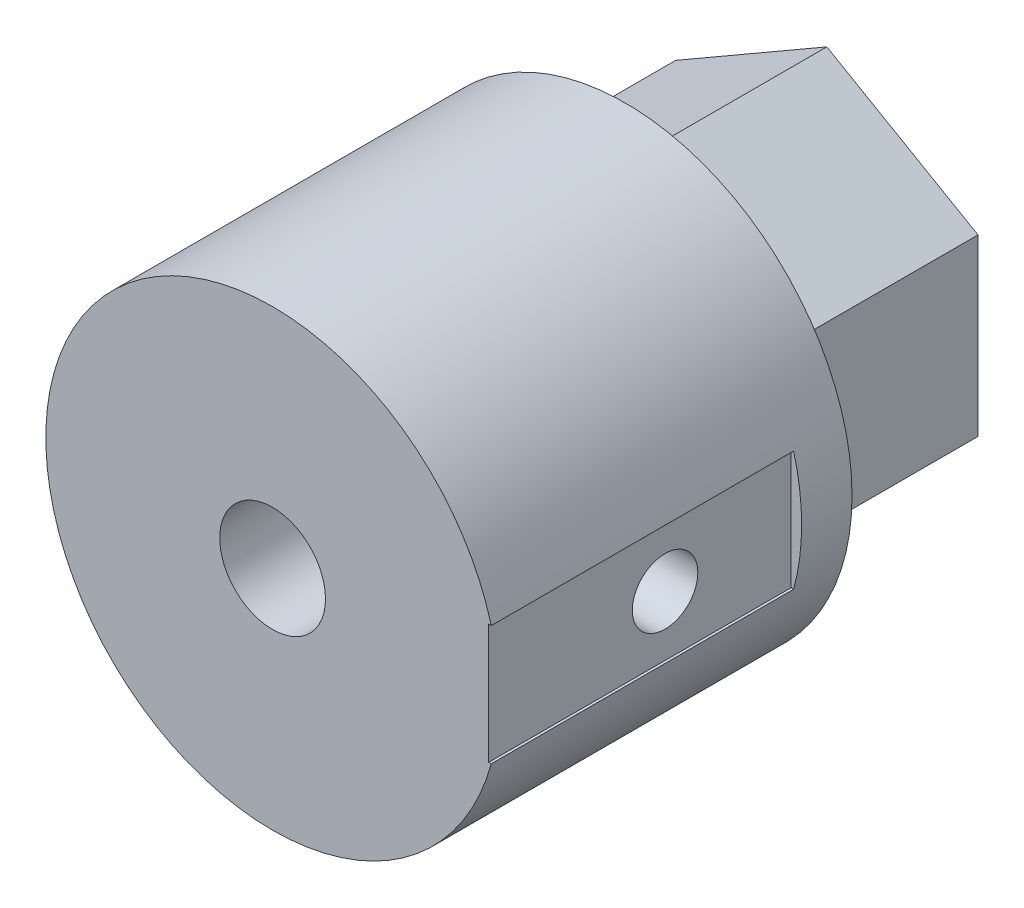
ISO-10303-21;
HEADER;
FILE_DESCRIPTION(('STEP AP214'),'2;1');
FILE_NAME('part.step','',(''),(''),'','','');
FILE_SCHEMA(('AUTOMOTIVE_DESIGN { 1 0 10303 214 1 1 1 1 }'));
ENDSEC;
DATA;
#1=APPLICATION_CONTEXT('core data for automotive mechanical design processes');
#2=APPLICATION_PROTOCOL_DEFINITION('international standard','automotive_design',2000,#1);
#3=PRODUCT_CONTEXT('',#1,'mechanical');
#4=PRODUCT('Part','Part','',(#3));
#5=PRODUCT_RELATED_PRODUCT_CATEGORY('part','',(#4));
#6=PRODUCT_DEFINITION_FORMATION('','',#4);
#7=PRODUCT_DEFINITION_CONTEXT('part definition',#1,'design');
#8=PRODUCT_DEFINITION('design','',#6,#7);
#9=PRODUCT_DEFINITION_SHAPE('','',#8);
#10=(LENGTH_UNIT() NAMED_UNIT(*) SI_UNIT(.MILLI.,.METRE.));
#11=(NAMED_UNIT(*) PLANE_ANGLE_UNIT() SI_UNIT($,.RADIAN.));
#12=(NAMED_UNIT(*) SI_UNIT($,.STERADIAN.) SOLID_ANGLE_UNIT());
#13=UNCERTAINTY_MEASURE_WITH_UNIT(LENGTH_MEASURE(1.E-05),#10,'distance_accuracy_value','');
#14=(GEOMETRIC_REPRESENTATION_CONTEXT(3) GLOBAL_UNCERTAINTY_ASSIGNED_CONTEXT((#13)) GLOBAL_UNIT_ASSIGNED_CONTEXT((#10,
#11,#12)) REPRESENTATION_CONTEXT('',''));
#15=CARTESIAN_POINT('',(0.,0.,0.));
#16=DIRECTION('',(0.,0.,1.));
#17=DIRECTION('',(1.,0.,0.));
#18=AXIS2_PLACEMENT_3D('',#15,#16,#17);
#19=CARTESIAN_POINT('',(6.,-3.46410161513775,22.));
#20=DIRECTION('',(-1.,0.,0.));
#21=DIRECTION('',(0.,-1.,0.));
#22=AXIS2_PLACEMENT_3D('',#19,#20,#21);
#23=PLANE('',#22);
#24=DIRECTION('',(0.,1.,0.));
#25=VECTOR('',#24,1.);
#26=CARTESIAN_POINT('',(6.,-3.46410161513775,8.));
#27=LINE('',#26,#25);
#28=CARTESIAN_POINT('',(6.,-3.46410161513775,8.));
#29=VERTEX_POINT('',#28);
#30=CARTESIAN_POINT('',(6.,3.46410161513775,8.));
#31=VERTEX_POINT('',#30);
#32=EDGE_CURVE('E165',#29,#31,#27,.T.);
#33=ORIENTED_EDGE('',*,*,#32,.F.);
#34=DIRECTION('',(0.,0.,-1.));
#35=VECTOR('',#34,1.);
#36=CARTESIAN_POINT('',(6.,-3.46410161513775,22.));
#37=LINE('',#36,#35);
#38=CARTESIAN_POINT('',(6.,-3.46410161513775,0.));
#39=VERTEX_POINT('',#38);
#40=EDGE_CURVE('E187',#29,#39,#37,.T.);
#41=ORIENTED_EDGE('',*,*,#40,.T.);
#42=DIRECTION('',(0.,1.,0.));
#43=VECTOR('',#42,1.);
#44=CARTESIAN_POINT('',(6.,-3.46410161513775,0.));
#45=LINE('',#44,#43);
#46=CARTESIAN_POINT('',(6.,3.46410161513775,0.));
#47=VERTEX_POINT('',#46);
#48=EDGE_CURVE('E169',#39,#47,#45,.T.);
#49=ORIENTED_EDGE('',*,*,#48,.T.);
#50=DIRECTION('',(0.,0.,-1.));
#51=VECTOR('',#50,1.);
#52=CARTESIAN_POINT('',(6.,3.46410161513775,22.));
#53=LINE('',#52,#51);
#54=EDGE_CURVE('E197',#31,#47,#53,.T.);
#55=ORIENTED_EDGE('',*,*,#54,.F.);
#56=EDGE_LOOP('',(#33,#41,#49,#55));
#57=FACE_BOUND('',#56,.T.);
#58=ADVANCED_FACE('F34',(#57),#23,.F.);
#59=CARTESIAN_POINT('',(6.,3.46410161513775,22.));
#60=DIRECTION('',(-0.5,-0.866025403784438,0.));
#61=DIRECTION('',(0.866025403784439,-0.5,0.));
#62=AXIS2_PLACEMENT_3D('',#59,#60,#61);
#63=PLANE('',#62);
#64=DIRECTION('',(-0.866025403784439,0.5,0.));
#65=VECTOR('',#64,1.);
#66=CARTESIAN_POINT('',(6.,3.46410161513775,8.));
#67=LINE('',#66,#65);
#68=CARTESIAN_POINT('',(0.,6.92820323027551,8.));
#69=VERTEX_POINT('',#68);
#70=EDGE_CURVE('E60',#31,#69,#67,.T.);
#71=ORIENTED_EDGE('',*,*,#70,.F.);
#72=ORIENTED_EDGE('',*,*,#54,.T.);
#73=DIRECTION('',(-0.866025403784439,0.5,0.));
#74=VECTOR('',#73,1.);
#75=CARTESIAN_POINT('',(6.,3.46410161513775,0.));
#76=LINE('',#75,#74);
#77=CARTESIAN_POINT('',(0.,6.92820323027551,0.));
#78=VERTEX_POINT('',#77);
#79=EDGE_CURVE('E172',#47,#78,#76,.T.);
#80=ORIENTED_EDGE('',*,*,#79,.T.);
#81=DIRECTION('',(0.,0.,-1.));
#82=VECTOR('',#81,1.);
#83=CARTESIAN_POINT('',(0.,6.92820323027551,22.));
#84=LINE('',#83,#82);
#85=EDGE_CURVE('E195',#69,#78,#84,.T.);
#86=ORIENTED_EDGE('',*,*,#85,.F.);
#87=EDGE_LOOP('',(#71,#72,#80,#86));
#88=FACE_BOUND('',#87,.T.);
#89=ADVANCED_FACE('F225',(#88),#63,.F.);
#90=CARTESIAN_POINT('',(0.,6.92820323027551,22.));
#91=DIRECTION('',(0.5,-0.866025403784439,0.));
#92=DIRECTION('',(0.866025403784439,0.5,0.));
#93=AXIS2_PLACEMENT_3D('',#90,#91,#92);
#94=PLANE('',#93);
#95=DIRECTION('',(-0.866025403784439,-0.5,0.));
#96=VECTOR('',#95,1.);
#97=CARTESIAN_POINT('',(0.,6.92820323027551,8.));
#98=LINE('',#97,#96);
#99=CARTESIAN_POINT('',(-6.,3.46410161513775,8.));
#100=VERTEX_POINT('',#99);
#101=EDGE_CURVE('E161',#69,#100,#98,.T.);
#102=ORIENTED_EDGE('',*,*,#101,.F.);
#103=ORIENTED_EDGE('',*,*,#85,.T.);
#104=DIRECTION('',(-0.866025403784439,-0.5,0.));
#105=VECTOR('',#104,1.);
#106=CARTESIAN_POINT('',(0.,6.92820323027551,0.));
#107=LINE('',#106,#105);
#108=CARTESIAN_POINT('',(-6.,3.46410161513775,0.));
#109=VERTEX_POINT('',#108);
#110=EDGE_CURVE('E175',#78,#109,#107,.T.);
#111=ORIENTED_EDGE('',*,*,#110,.T.);
#112=DIRECTION('',(0.,0.,-1.));
#113=VECTOR('',#112,1.);
#114=CARTESIAN_POINT('',(-6.,3.46410161513775,22.));
#115=LINE('',#114,#113);
#116=EDGE_CURVE('E193',#100,#109,#115,.T.);
#117=ORIENTED_EDGE('',*,*,#116,.F.);
#118=EDGE_LOOP('',(#102,#103,#111,#117));
#119=FACE_BOUND('',#118,.T.);
#120=ADVANCED_FACE('F230',(#119),#94,.F.);
#121=CARTESIAN_POINT('',(-6.,3.46410161513775,22.));
#122=DIRECTION('',(1.,0.,0.));
#123=DIRECTION('',(0.,1.,0.));
#124=AXIS2_PLACEMENT_3D('',#121,#122,#123);
#125=PLANE('',#124);
#126=DIRECTION('',(0.,-1.,0.));
#127=VECTOR('',#126,1.);
#128=CARTESIAN_POINT('',(-6.,3.46410161513775,8.));
#129=LINE('',#128,#127);
#130=CARTESIAN_POINT('',(-6.,-3.46410161513776,8.));
#131=VERTEX_POINT('',#130);
#132=EDGE_CURVE('E158',#100,#131,#129,.T.);
#133=ORIENTED_EDGE('',*,*,#132,.F.);
#134=ORIENTED_EDGE('',*,*,#116,.T.);
#135=DIRECTION('',(0.,-1.,0.));
#136=VECTOR('',#135,1.);
#137=CARTESIAN_POINT('',(-6.,3.46410161513775,0.));
#138=LINE('',#137,#136);
#139=CARTESIAN_POINT('',(-6.,-3.46410161513776,0.));
#140=VERTEX_POINT('',#139);
#141=EDGE_CURVE('E178',#109,#140,#138,.T.);
#142=ORIENTED_EDGE('',*,*,#141,.T.);
#143=DIRECTION('',(0.,0.,-1.));
#144=VECTOR('',#143,1.);
#145=CARTESIAN_POINT('',(-6.,-3.46410161513776,22.));
#146=LINE('',#145,#144);
#147=EDGE_CURVE('E191',#131,#140,#146,.T.);
#148=ORIENTED_EDGE('',*,*,#147,.F.);
#149=EDGE_LOOP('',(#133,#134,#142,#148));
#150=FACE_BOUND('',#149,.T.);
#151=ADVANCED_FACE('F250',(#150),#125,.F.);
#152=CARTESIAN_POINT('',(-6.,-3.46410161513776,22.));
#153=DIRECTION('',(0.5,0.866025403784439,0.));
#154=DIRECTION('',(-0.866025403784439,0.5,0.));
#155=AXIS2_PLACEMENT_3D('',#152,#153,#154);
#156=PLANE('',#155);
#157=DIRECTION('',(0.866025403784439,-0.5,0.));
#158=VECTOR('',#157,1.);
#159=CARTESIAN_POINT('',(-6.,-3.46410161513776,8.));
#160=LINE('',#159,#158);
#161=CARTESIAN_POINT('',(0.,-6.92820323027551,8.));
#162=VERTEX_POINT('',#161);
#163=EDGE_CURVE('E155',#131,#162,#160,.T.);
#164=ORIENTED_EDGE('',*,*,#163,.F.);
#165=ORIENTED_EDGE('',*,*,#147,.T.);
#166=DIRECTION('',(0.866025403784439,-0.5,0.));
#167=VECTOR('',#166,1.);
#168=CARTESIAN_POINT('',(-6.,-3.46410161513776,0.));
#169=LINE('',#168,#167);
#170=CARTESIAN_POINT('',(0.,-6.92820323027551,0.));
#171=VERTEX_POINT('',#170);
#172=EDGE_CURVE('E181',#140,#171,#169,.T.);
#173=ORIENTED_EDGE('',*,*,#172,.T.);
#174=DIRECTION('',(0.,0.,-1.));
#175=VECTOR('',#174,1.);
#176=CARTESIAN_POINT('',(0.,-6.92820323027551,22.));
#177=LINE('',#176,#175);
#178=EDGE_CURVE('E189',#162,#171,#177,.T.);
#179=ORIENTED_EDGE('',*,*,#178,.F.);
#180=EDGE_LOOP('',(#164,#165,#173,#179));
#181=FACE_BOUND('',#180,.T.);
#182=ADVANCED_FACE('F237',(#181),#156,.F.);
#183=CARTESIAN_POINT('',(0.,-6.92820323027551,22.));
#184=DIRECTION('',(-0.5,0.866025403784439,0.));
#185=DIRECTION('',(-0.866025403784439,-0.5,0.));
#186=AXIS2_PLACEMENT_3D('',#183,#184,#185);
#187=PLANE('',#186);
#188=DIRECTION('',(0.866025403784439,0.5,0.));
#189=VECTOR('',#188,1.);
#190=CARTESIAN_POINT('',(0.,-6.92820323027551,8.));
#191=LINE('',#190,#189);
#192=EDGE_CURVE('E150',#162,#29,#191,.T.);
#193=ORIENTED_EDGE('',*,*,#192,.F.);
#194=ORIENTED_EDGE('',*,*,#178,.T.);
#195=DIRECTION('',(0.866025403784439,0.5,0.));
#196=VECTOR('',#195,1.);
#197=CARTESIAN_POINT('',(0.,-6.92820323027551,0.));
#198=LINE('',#197,#196);
#199=EDGE_CURVE('E184',#171,#39,#198,.T.);
#200=ORIENTED_EDGE('',*,*,#199,.T.);
#201=ORIENTED_EDGE('',*,*,#40,.F.);
#202=EDGE_LOOP('',(#193,#194,#200,#201));
#203=FACE_BOUND('',#202,.T.);
#204=ADVANCED_FACE('F235',(#203),#187,.F.);
#205=CARTESIAN_POINT('',(0.,0.,-1.00000000000001));
#206=DIRECTION('',(0.,0.,1.));
#207=DIRECTION('',(1.,0.,0.));
#208=AXIS2_PLACEMENT_3D('',#205,#206,#207);
#209=CYLINDRICAL_SURFACE('',#208,1.7);
#210=CARTESIAN_POINT('',(0.,0.,0.));
#211=DIRECTION('',(0.,0.,1.));
#212=DIRECTION('',(1.,0.,0.));
#213=AXIS2_PLACEMENT_3D('',#210,#211,#212);
#214=CIRCLE('',#213,1.7);
#215=CARTESIAN_POINT('',(1.7,0.,0.));
#216=VERTEX_POINT('',#215);
#217=EDGE_CURVE('E168',#216,#216,#214,.T.);
#218=ORIENTED_EDGE('',*,*,#217,.F.);
#219=EDGE_LOOP('',(#218));
#220=FACE_BOUND('',#219,.T.);
#221=CARTESIAN_POINT('',(0.,0.,7.99999999999999));
#222=DIRECTION('',(0.,0.,1.));
#223=DIRECTION('',(1.,0.,0.));
#224=AXIS2_PLACEMENT_3D('',#221,#222,#223);
#225=CIRCLE('',#224,1.7);
#226=CARTESIAN_POINT('',(1.7,0.,7.99999999999999));
#227=VERTEX_POINT('',#226);
#228=EDGE_CURVE('E297',#227,#227,#225,.F.);
#229=ORIENTED_EDGE('',*,*,#228,.F.);
#230=EDGE_LOOP('',(#229));
#231=FACE_BOUND('',#230,.T.);
#232=ADVANCED_FACE('F262',(#220,#231),#209,.F.);
#233=CARTESIAN_POINT('',(0.,0.,0.));
#234=DIRECTION('',(0.,0.,1.));
#235=DIRECTION('',(1.,0.,0.));
#236=AXIS2_PLACEMENT_3D('',#233,#234,#235);
#237=PLANE('',#236);
#238=ORIENTED_EDGE('',*,*,#217,.T.);
#239=EDGE_LOOP('',(#238));
#240=FACE_BOUND('',#239,.T.);
#241=ORIENTED_EDGE('',*,*,#48,.F.);
#242=ORIENTED_EDGE('',*,*,#199,.F.);
#243=ORIENTED_EDGE('',*,*,#172,.F.);
#244=ORIENTED_EDGE('',*,*,#141,.F.);
#245=ORIENTED_EDGE('',*,*,#110,.F.);
#246=ORIENTED_EDGE('',*,*,#79,.F.);
#247=EDGE_LOOP('',(#241,#242,#243,#244,#245,#246));
#248=FACE_BOUND('',#247,.T.);
#249=ADVANCED_FACE('F244',(#240,#248),#237,.F.);
#250=CARTESIAN_POINT('',(0.,0.,22.));
#251=DIRECTION('',(0.,0.,1.));
#252=DIRECTION('',(1.,0.,0.));
#253=AXIS2_PLACEMENT_3D('',#250,#251,#252);
#254=PLANE('',#253);
#255=CARTESIAN_POINT('',(0.,0.,22.));
#256=DIRECTION('',(0.,0.,1.));
#257=DIRECTION('',(1.,0.,0.));
#258=AXIS2_PLACEMENT_3D('',#255,#256,#257);
#259=CIRCLE('',#258,2.1);
#260=CARTESIAN_POINT('',(2.1,0.,22.));
#261=VERTEX_POINT('',#260);
#262=EDGE_CURVE('E298',#261,#261,#259,.T.);
#263=ORIENTED_EDGE('',*,*,#262,.F.);
#264=EDGE_LOOP('',(#263));
#265=FACE_BOUND('',#264,.T.);
#266=DIRECTION('',(1.,0.,0.));
#267=VECTOR('',#266,1.);
#268=CARTESIAN_POINT('',(8.57868638007796,-2.37573749863627,22.));
#269=LINE('',#268,#267);
#270=CARTESIAN_POINT('',(8.57868638007796,-2.37573749863627,22.));
#271=VERTEX_POINT('',#270);
#272=CARTESIAN_POINT('',(8.68077596402381,-2.37573749863627,22.));
#273=VERTEX_POINT('',#272);
#274=EDGE_CURVE('E123',#271,#273,#269,.T.);
#275=ORIENTED_EDGE('',*,*,#274,.F.);
#276=DIRECTION('',(0.,-1.,0.));
#277=VECTOR('',#276,1.);
#278=CARTESIAN_POINT('',(8.57868638007796,-2.37573749863627,22.));
#279=LINE('',#278,#277);
#280=CARTESIAN_POINT('',(8.57868638007796,2.37573749863626,22.));
#281=VERTEX_POINT('',#280);
#282=EDGE_CURVE('E141',#281,#271,#279,.T.);
#283=ORIENTED_EDGE('',*,*,#282,.F.);
#284=DIRECTION('',(-1.,0.,0.));
#285=VECTOR('',#284,1.);
#286=CARTESIAN_POINT('',(8.57868638007796,2.37573749863626,22.));
#287=LINE('',#286,#285);
#288=CARTESIAN_POINT('',(8.68077596402381,2.37573749863626,22.));
#289=VERTEX_POINT('',#288);
#290=EDGE_CURVE('E129',#289,#281,#287,.T.);
#291=ORIENTED_EDGE('',*,*,#290,.F.);
#292=CARTESIAN_POINT('',(0.,0.,22.));
#293=DIRECTION('',(0.,0.,1.));
#294=DIRECTION('',(1.,0.,0.));
#295=AXIS2_PLACEMENT_3D('',#292,#293,#294);
#296=CIRCLE('',#295,9.);
#297=EDGE_CURVE('E145',#289,#273,#296,.T.);
#298=ORIENTED_EDGE('',*,*,#297,.T.);
#299=EDGE_LOOP('',(#275,#283,#291,#298));
#300=FACE_BOUND('',#299,.T.);
#301=ADVANCED_FACE('F206',(#265,#300),#254,.T.);
#302=CARTESIAN_POINT('',(0.,0.,8.));
#303=DIRECTION('',(0.,0.,1.));
#304=DIRECTION('',(1.,0.,0.));
#305=AXIS2_PLACEMENT_3D('',#302,#303,#304);
#306=PLANE('',#305);
#307=CARTESIAN_POINT('',(0.,0.,8.));
#308=DIRECTION('',(0.,0.,1.));
#309=DIRECTION('',(1.,0.,0.));
#310=AXIS2_PLACEMENT_3D('',#307,#308,#309);
#311=CIRCLE('',#310,9.);
#312=CARTESIAN_POINT('',(9.,0.,8.));
#313=VERTEX_POINT('',#312);
#314=EDGE_CURVE('E147',#313,#313,#311,.T.);
#315=ORIENTED_EDGE('',*,*,#314,.F.);
#316=EDGE_LOOP('',(#315));
#317=FACE_BOUND('',#316,.T.);
#318=ORIENTED_EDGE('',*,*,#192,.T.);
#319=ORIENTED_EDGE('',*,*,#32,.T.);
#320=ORIENTED_EDGE('',*,*,#70,.T.);
#321=ORIENTED_EDGE('',*,*,#101,.T.);
#322=ORIENTED_EDGE('',*,*,#132,.T.);
#323=ORIENTED_EDGE('',*,*,#163,.T.);
#324=EDGE_LOOP('',(#318,#319,#320,#321,#322,#323));
#325=FACE_BOUND('',#324,.T.);
#326=ADVANCED_FACE('F220',(#317,#325),#306,.F.);
#327=CARTESIAN_POINT('',(0.,0.,8.));
#328=DIRECTION('',(0.,0.,1.));
#329=DIRECTION('',(1.,0.,0.));
#330=AXIS2_PLACEMENT_3D('',#327,#328,#329);
#331=CYLINDRICAL_SURFACE('',#330,9.);
#332=CARTESIAN_POINT('',(-9.,0.,13.7));
#333=CARTESIAN_POINT('',(-8.99999886685049,-0.0726161825161227,13.7000030179057));
#334=CARTESIAN_POINT('',(-8.99911192088851,-0.145275273356691,13.7061048925621));
#335=CARTESIAN_POINT('',(-8.99565906742254,-0.288564680588737,13.7303462177474));
#336=CARTESIAN_POINT('',(-8.9930914970246,-0.359192915218875,13.7484975909057));
#337=CARTESIAN_POINT('',(-8.98656610157761,-0.49632601369094,13.7962860504916));
#338=CARTESIAN_POINT('',(-8.98260930038149,-0.562833871867999,13.8259146799222));
#339=CARTESIAN_POINT('',(-8.97374334347608,-0.689922979183434,13.8957964288494));
#340=CARTESIAN_POINT('',(-8.96883432739334,-0.750505095276922,13.9360479909805));
#341=CARTESIAN_POINT('',(-8.95857047423112,-0.864473940159737,14.0263448505381));
#342=CARTESIAN_POINT('',(-8.95321294862107,-0.917811379037878,14.076452060509));
#343=CARTESIAN_POINT('',(-8.94267709434867,-1.01535172198024,14.1849046681725));
#344=CARTESIAN_POINT('',(-8.93749877571418,-1.05955411556233,14.2432505259486));
#345=CARTESIAN_POINT('',(-8.92788149846685,-1.13775964079836,14.3668529449777));
#346=CARTESIAN_POINT('',(-8.92344601308425,-1.17171542458719,14.4321397577465));
#347=CARTESIAN_POINT('',(-8.91585306506849,-1.22816132370236,14.5675644894435));
#348=CARTESIAN_POINT('',(-8.91269553787813,-1.25065201821292,14.6377021631165));
#349=CARTESIAN_POINT('',(-8.90804229933286,-1.28337696964788,14.7803207327257));
#350=CARTESIAN_POINT('',(-8.90653518527196,-1.2936953638146,14.8527819439515));
#351=CARTESIAN_POINT('',(-8.90531874187228,-1.30204339248276,14.9984218561183));
#352=CARTESIAN_POINT('',(-8.90560931670267,-1.30007368203592,15.071600518606));
#353=CARTESIAN_POINT('',(-8.9079449895514,-1.28397024472981,15.2160056168021));
#354=CARTESIAN_POINT('',(-8.90997660637288,-1.26992997965499,15.2872427243279));
#355=CARTESIAN_POINT('',(-8.91554440166498,-1.23023017528381,15.4263392258918));
#356=CARTESIAN_POINT('',(-8.91908061985619,-1.20457032923634,15.4941985307051));
#357=CARTESIAN_POINT('',(-8.92727416310496,-1.14226177749905,15.6248989335556));
#358=CARTESIAN_POINT('',(-8.93193553951083,-1.10557324101686,15.6877207787645));
#359=CARTESIAN_POINT('',(-8.94185120777938,-1.02227715681356,15.806351737727));
#360=CARTESIAN_POINT('',(-8.94710553575573,-0.975669004785745,15.8621604239067));
#361=CARTESIAN_POINT('',(-8.95767473328203,-0.873342522317744,15.9657227277226));
#362=CARTESIAN_POINT('',(-8.96298971271745,-0.81754378704045,16.0133969246415));
#363=CARTESIAN_POINT('',(-8.97303606405221,-0.698694761830923,16.0987159186785));
#364=CARTESIAN_POINT('',(-8.97776743372044,-0.635644444178102,16.1363606774553));
#365=CARTESIAN_POINT('',(-8.98611790270109,-0.504014985474141,16.2005553213372));
#366=CARTESIAN_POINT('',(-8.98973641497596,-0.435432950409739,16.2270993534036));
#367=CARTESIAN_POINT('',(-8.99544847162129,-0.294720866423351,16.2682714414607));
#368=CARTESIAN_POINT('',(-8.99754211152437,-0.222591040071335,16.2829002439424));
#369=CARTESIAN_POINT('',(-8.99995593179461,-0.0775166261160503,16.299721642539));
#370=CARTESIAN_POINT('',(-9.00029168947683,-0.00458495421052973,16.3020234771541));
#371=CARTESIAN_POINT('',(-8.99919423576155,0.140623283962608,16.2944151554449));
#372=CARTESIAN_POINT('',(-8.99776107503573,0.212899868935824,16.2845053489299));
#373=CARTESIAN_POINT('',(-8.99329645841354,0.354417411864374,16.2528458689571));
#374=CARTESIAN_POINT('',(-8.9902721524901,0.423670460731397,16.2311491471084));
#375=CARTESIAN_POINT('',(-8.98296337093671,0.557555721570268,16.176587379013));
#376=CARTESIAN_POINT('',(-8.97867883989296,0.622187730193371,16.1437218416486));
#377=CARTESIAN_POINT('',(-8.96928732992692,0.745478388085474,16.0674971952821));
#378=CARTESIAN_POINT('',(-8.96417497293068,0.804093577429588,16.0240684660163));
#379=CARTESIAN_POINT('',(-8.95371432258047,0.913242498234218,15.9280475149851));
#380=CARTESIAN_POINT('',(-8.94836601657276,0.963775795595857,15.8754548013159));
#381=CARTESIAN_POINT('',(-8.93798717240551,1.05572162102025,15.7621136669887));
#382=CARTESIAN_POINT('',(-8.93295939058988,1.09706111033544,15.7013057046283));
#383=CARTESIAN_POINT('',(-8.923838865449,1.16893890037995,15.5735448558142));
#384=CARTESIAN_POINT('',(-8.91974609833166,1.19947747595672,15.5065921257792));
#385=CARTESIAN_POINT('',(-8.91297870028431,1.24877215075929,15.3686643095023));
#386=CARTESIAN_POINT('',(-8.9102993697419,1.26756733516503,15.2977034327738));
#387=CARTESIAN_POINT('',(-8.90664948831333,1.29296647663047,15.1535909265383));
#388=CARTESIAN_POINT('',(-8.9056788287146,1.29957120929748,15.0804394367082));
#389=CARTESIAN_POINT('',(-8.90556004646843,1.30038450985761,14.9347498466062));
#390=CARTESIAN_POINT('',(-8.90639504347657,1.29470789084417,14.862212374777));
#391=CARTESIAN_POINT('',(-8.90975689966459,1.27136497418117,14.719134963244));
#392=CARTESIAN_POINT('',(-8.91228375689653,1.25369869033602,14.6485950212403));
#393=CARTESIAN_POINT('',(-8.91873888003025,1.20691743721873,14.5115429219884));
#394=CARTESIAN_POINT('',(-8.92266623507524,1.17780990785681,14.4450281796397));
#395=CARTESIAN_POINT('',(-8.93148103266922,1.10898377517461,14.3178078654696));
#396=CARTESIAN_POINT('',(-8.93636850293434,1.06926486551846,14.2571024614245));
#397=CARTESIAN_POINT('',(-8.94660732762801,0.979924120983317,14.1426397736083));
#398=CARTESIAN_POINT('',(-8.95196243152711,0.930217100043667,14.088949307888));
#399=CARTESIAN_POINT('',(-8.96250140061062,0.822490977248042,13.9906303225525));
#400=CARTESIAN_POINT('',(-8.96768522558605,0.764469940438544,13.9460039183128));
#401=CARTESIAN_POINT('',(-8.97732749397021,0.641417167729072,13.8668788940298));
#402=CARTESIAN_POINT('',(-8.98178211378627,0.57635127453404,13.8324329411212));
#403=CARTESIAN_POINT('',(-8.98942636807162,0.441325364686636,13.7750089559894));
#404=CARTESIAN_POINT('',(-8.99261732736653,0.371370564617911,13.7520189067925));
#405=CARTESIAN_POINT('',(-8.996636556397,0.250908337539317,13.7234437933782));
#406=CARTESIAN_POINT('',(-8.9978914500348,0.201148595189125,13.7146656130017));
#407=CARTESIAN_POINT('',(-8.99957356107547,0.100932807663756,13.7029426998114));
#408=CARTESIAN_POINT('',(-9.00000078767192,0.0504767702291778,13.6999979022013));
#409=CARTESIAN_POINT('',(-9.,0.,13.7));
#410=B_SPLINE_CURVE_WITH_KNOTS('',3,(#332,#333,#334,#335,#336,#337,#338,#339,#340,#341,#342,
#343,#344,#345,#346,#347,#348,#349,#350,#351,#352,#353,#354,#355,#356,#357,#358,#359,#360,#361,
#362,#363,#364,#365,#366,#367,#368,#369,#370,#371,#372,#373,#374,#375,#376,#377,#378,#379,#380,
#381,#382,#383,#384,#385,#386,#387,#388,#389,#390,#391,#392,#393,#394,#395,#396,#397,#398,#399,
#400,#401,#402,#403,#404,#405,#406,#407,#408,#409),.UNSPECIFIED.,.T.,.F.,(4,2,2,2,2,2,2,2,2,2,2,
2,2,2,2,2,2,2,2,2,2,2,2,2,2,2,2,2,2,2,2,2,2,2,2,2,2,2,4),(0.,0.217664117538774,
0.435543929073118,0.653263500685468,0.870951171430811,1.09005272939449,1.30916652782325,
1.52927783394998,1.74937801956735,1.96794774674852,2.18650582255975,2.40338669936715,
2.62027330205483,2.8379528120351,3.05564558693094,3.27535528243951,3.49506581785913,
3.71489205361863,3.9347045161696,4.15256579262198,4.37042082845833,4.58730516812195,
4.80419904590826,5.02256313228881,5.24093894362097,5.46099211648741,5.68103968932729,
5.90035092758197,6.1196482118612,6.33690424452957,6.55416002705853,6.77127476755009,
6.98839577652114,7.20745379436974,7.42656287750507,7.6467864085655,7.86677844144402,
8.01808223229382,8.16938434247707),.UNSPECIFIED.);
#411=CARTESIAN_POINT('',(-9.,0.,13.7));
#412=VERTEX_POINT('',#411);
#413=EDGE_CURVE('E142',#412,#412,#410,.T.);
#414=ORIENTED_EDGE('',*,*,#413,.F.);
#415=EDGE_LOOP('',(#414));
#416=FACE_BOUND('',#415,.T.);
#417=DIRECTION('',(0.,0.,1.));
#418=VECTOR('',#417,1.);
#419=CARTESIAN_POINT('',(8.68077596402381,-2.37573749863627,8.));
#420=LINE('',#419,#418);
#421=CARTESIAN_POINT('',(8.68077596402381,-2.37573749863627,10.));
#422=VERTEX_POINT('',#421);
#423=EDGE_CURVE('E12',#273,#422,#420,.F.);
#424=ORIENTED_EDGE('',*,*,#423,.F.);
#425=ORIENTED_EDGE('',*,*,#297,.F.);
#426=DIRECTION('',(0.,0.,1.));
#427=VECTOR('',#426,1.);
#428=CARTESIAN_POINT('',(8.68077596402381,2.37573749863626,8.));
#429=LINE('',#428,#427);
#430=CARTESIAN_POINT('',(8.68077596402381,2.37573749863626,10.));
#431=VERTEX_POINT('',#430);
#432=EDGE_CURVE('E46',#431,#289,#429,.T.);
#433=ORIENTED_EDGE('',*,*,#432,.F.);
#434=CARTESIAN_POINT('',(0.,0.,10.));
#435=DIRECTION('',(0.,0.,-1.));
#436=DIRECTION('',(-1.,0.,0.));
#437=AXIS2_PLACEMENT_3D('',#434,#435,#436);
#438=CIRCLE('',#437,9.);
#439=EDGE_CURVE('E120',#422,#431,#438,.F.);
#440=ORIENTED_EDGE('',*,*,#439,.F.);
#441=EDGE_LOOP('',(#424,#425,#433,#440));
#442=FACE_BOUND('',#441,.T.);
#443=ORIENTED_EDGE('',*,*,#314,.T.);
#444=EDGE_LOOP('',(#443));
#445=FACE_BOUND('',#444,.T.);
#446=ADVANCED_FACE('F208',(#416,#442,#445),#331,.T.);
#447=CARTESIAN_POINT('',(8.57868638007796,-2.37573749863627,10.));
#448=DIRECTION('',(0.,-1.,0.));
#449=DIRECTION('',(0.,0.,-1.));
#450=AXIS2_PLACEMENT_3D('',#447,#448,#449);
#451=PLANE('',#450);
#452=ORIENTED_EDGE('',*,*,#423,.T.);
#453=DIRECTION('',(1.,0.,0.));
#454=VECTOR('',#453,1.);
#455=CARTESIAN_POINT('',(8.57868638007796,-2.37573749863627,10.));
#456=LINE('',#455,#454);
#457=CARTESIAN_POINT('',(8.57868638007796,-2.37573749863627,10.));
#458=VERTEX_POINT('',#457);
#459=EDGE_CURVE('E53',#458,#422,#456,.T.);
#460=ORIENTED_EDGE('',*,*,#459,.F.);
#461=DIRECTION('',(0.,0.,1.));
#462=VECTOR('',#461,1.);
#463=CARTESIAN_POINT('',(8.57868638007796,-2.37573749863627,10.));
#464=LINE('',#463,#462);
#465=EDGE_CURVE('E133',#458,#271,#464,.T.);
#466=ORIENTED_EDGE('',*,*,#465,.T.);
#467=ORIENTED_EDGE('',*,*,#274,.T.);
#468=EDGE_LOOP('',(#452,#460,#466,#467));
#469=FACE_BOUND('',#468,.T.);
#470=ADVANCED_FACE('F211',(#469),#451,.F.);
#471=CARTESIAN_POINT('',(8.57868638007796,-2.37573749863627,10.));
#472=DIRECTION('',(-1.,0.,0.));
#473=DIRECTION('',(0.,0.,1.));
#474=AXIS2_PLACEMENT_3D('',#471,#472,#473);
#475=PLANE('',#474);
#476=CARTESIAN_POINT('',(8.57868638007796,0.,15.));
#477=DIRECTION('',(1.,0.,0.));
#478=DIRECTION('',(0.,0.,-1.));
#479=AXIS2_PLACEMENT_3D('',#476,#477,#478);
#480=CIRCLE('',#479,1.3);
#481=CARTESIAN_POINT('',(8.57868638007796,0.,13.7));
#482=VERTEX_POINT('',#481);
#483=EDGE_CURVE('E278',#482,#482,#480,.T.);
#484=ORIENTED_EDGE('',*,*,#483,.F.);
#485=EDGE_LOOP('',(#484));
#486=FACE_BOUND('',#485,.T.);
#487=ORIENTED_EDGE('',*,*,#282,.T.);
#488=ORIENTED_EDGE('',*,*,#465,.F.);
#489=DIRECTION('',(0.,-1.,0.));
#490=VECTOR('',#489,1.);
#491=CARTESIAN_POINT('',(8.57868638007796,-2.37573749863627,10.));
#492=LINE('',#491,#490);
#493=CARTESIAN_POINT('',(8.57868638007796,2.37573749863626,10.));
#494=VERTEX_POINT('',#493);
#495=EDGE_CURVE('E118',#494,#458,#492,.T.);
#496=ORIENTED_EDGE('',*,*,#495,.F.);
#497=DIRECTION('',(0.,0.,1.));
#498=VECTOR('',#497,1.);
#499=CARTESIAN_POINT('',(8.57868638007796,2.37573749863626,10.));
#500=LINE('',#499,#498);
#501=EDGE_CURVE('E126',#494,#281,#500,.T.);
#502=ORIENTED_EDGE('',*,*,#501,.T.);
#503=EDGE_LOOP('',(#487,#488,#496,#502));
#504=FACE_BOUND('',#503,.T.);
#505=ADVANCED_FACE('F135',(#486,#504),#475,.F.);
#506=CARTESIAN_POINT('',(8.57868638007796,2.37573749863626,10.));
#507=DIRECTION('',(0.,1.,0.));
#508=DIRECTION('',(0.,0.,1.));
#509=AXIS2_PLACEMENT_3D('',#506,#507,#508);
#510=PLANE('',#509);
#511=ORIENTED_EDGE('',*,*,#432,.T.);
#512=ORIENTED_EDGE('',*,*,#290,.T.);
#513=ORIENTED_EDGE('',*,*,#501,.F.);
#514=DIRECTION('',(-1.,0.,0.));
#515=VECTOR('',#514,1.);
#516=CARTESIAN_POINT('',(8.57868638007796,2.37573749863626,10.));
#517=LINE('',#516,#515);
#518=EDGE_CURVE('E114',#431,#494,#517,.T.);
#519=ORIENTED_EDGE('',*,*,#518,.F.);
#520=EDGE_LOOP('',(#511,#512,#513,#519));
#521=FACE_BOUND('',#520,.T.);
#522=ADVANCED_FACE('F127',(#521),#510,.F.);
#523=CARTESIAN_POINT('',(0.,0.,10.));
#524=DIRECTION('',(0.,0.,-1.));
#525=DIRECTION('',(-1.,0.,0.));
#526=AXIS2_PLACEMENT_3D('',#523,#524,#525);
#527=PLANE('',#526);
#528=ORIENTED_EDGE('',*,*,#439,.T.);
#529=ORIENTED_EDGE('',*,*,#518,.T.);
#530=ORIENTED_EDGE('',*,*,#495,.T.);
#531=ORIENTED_EDGE('',*,*,#459,.T.);
#532=EDGE_LOOP('',(#528,#529,#530,#531));
#533=FACE_BOUND('',#532,.T.);
#534=ADVANCED_FACE('F116',(#533),#527,.F.);
#535=CARTESIAN_POINT('',(-18.421313619922,0.,15.));
#536=DIRECTION('',(1.,0.,0.));
#537=DIRECTION('',(0.,0.,-1.));
#538=AXIS2_PLACEMENT_3D('',#535,#536,#537);
#539=CYLINDRICAL_SURFACE('',#538,1.3);
#540=CARTESIAN_POINT('',(2.1,0.,13.7));
#541=CARTESIAN_POINT('',(2.09999592521546,-0.0661584725627303,13.7000043961658));
#542=CARTESIAN_POINT('',(2.09684060553243,-0.132402130105004,13.7050847768142));
#543=CARTESIAN_POINT('',(2.08451827939458,-0.262867337890483,13.725136611613));
#544=CARTESIAN_POINT('',(2.07533898847571,-0.327084474454251,13.7401282779496));
#545=CARTESIAN_POINT('',(2.05189322117352,-0.451346237081739,13.7791368058104));
#546=CARTESIAN_POINT('',(2.0376519641904,-0.511409815716775,13.8031089567296));
#547=CARTESIAN_POINT('',(2.00527459730511,-0.626458725437602,13.8591025195503));
#548=CARTESIAN_POINT('',(1.98713904260172,-0.68144477881516,13.8911227841663));
#549=CARTESIAN_POINT('',(1.94678563978927,-0.78969619497588,13.9651026622645));
#550=CARTESIAN_POINT('',(1.9243583816122,-0.842481659521358,14.0076480185819));
#551=CARTESIAN_POINT('',(1.87833767537554,-0.940634354069635,14.1001317779659));
#552=CARTESIAN_POINT('',(1.85474270535462,-0.985991552019142,14.1500800082756));
#553=CARTESIAN_POINT('',(1.80531777127424,-1.07410438743368,14.2637027032458));
#554=CARTESIAN_POINT('',(1.779605262846,-1.11572137091706,14.3283189100844));
#555=CARTESIAN_POINT('',(1.73262362597647,-1.18737398590676,14.4651356694186));
#556=CARTESIAN_POINT('',(1.71134708052571,-1.2174290214935,14.5373232536066));
#557=CARTESIAN_POINT('',(1.68134345669534,-1.25839481688526,14.6685106655202));
#558=CARTESIAN_POINT('',(1.67079969270136,-1.27223321559786,14.7261782753493));
#559=CARTESIAN_POINT('',(1.65562458660159,-1.29192385809486,14.8435909393596));
#560=CARTESIAN_POINT('',(1.6509851417835,-1.2977870473124,14.9033330306621));
#561=CARTESIAN_POINT('',(1.64831399449792,-1.30117913497181,15.0233539218511));
#562=CARTESIAN_POINT('',(1.65029849456101,-1.29868759722699,15.0836336775456));
#563=CARTESIAN_POINT('',(1.66059504849629,-1.28549195135012,15.2027508001185));
#564=CARTESIAN_POINT('',(1.66891210560678,-1.27478134943217,15.2615869885009));
#565=CARTESIAN_POINT('',(1.69046533177965,-1.2460485951576,15.3751371428163));
#566=CARTESIAN_POINT('',(1.70359821016581,-1.22817928885749,15.4299105458169));
#567=CARTESIAN_POINT('',(1.73334848680728,-1.1858210026514,15.5358029705517));
#568=CARTESIAN_POINT('',(1.74996712642503,-1.16132966358153,15.5869206816873));
#569=CARTESIAN_POINT('',(1.78851004522184,-1.10123842568689,15.6940527847813));
#570=CARTESIAN_POINT('',(1.81084788027945,-1.06442362438143,15.7492368187148));
#571=CARTESIAN_POINT('',(1.85629507893708,-0.983029068737406,15.8532417239369));
#572=CARTESIAN_POINT('',(1.87940520461858,-0.938441449791709,15.9020560619903));
#573=CARTESIAN_POINT('',(1.92810000853828,-0.834401999779431,15.9998206715178));
#574=CARTESIAN_POINT('',(1.95349586016988,-0.77371426290383,16.0475646930291));
#575=CARTESIAN_POINT('',(2.00010846364422,-0.643682245250697,16.1321112341572));
#576=CARTESIAN_POINT('',(2.02132702082652,-0.574341725288904,16.1689184839369));
#577=CARTESIAN_POINT('',(2.05613988742858,-0.432774004204624,16.2281085116787));
#578=CARTESIAN_POINT('',(2.07009764548966,-0.360932102004443,16.251189586685));
#579=CARTESIAN_POINT('',(2.09045648949532,-0.213340794412888,16.2845964242982));
#580=CARTESIAN_POINT('',(2.09686786640824,-0.13759685777665,16.2949395584756));
#581=CARTESIAN_POINT('',(2.10100954931623,0.00364574233685598,16.3016306005272));
#582=CARTESIAN_POINT('',(2.09986668621279,0.0690324995168301,16.299794985612));
#583=CARTESIAN_POINT('',(2.09160955950657,0.198412601743836,16.2864132655175));
#584=CARTESIAN_POINT('',(2.0844956249399,0.262406023371331,16.2748676954057));
#585=CARTESIAN_POINT('',(2.06531369218127,0.384963315348103,16.243250195414));
#586=CARTESIAN_POINT('',(2.05342982398813,0.4436391716169,16.2234942953285));
#587=CARTESIAN_POINT('',(2.02567947304524,0.556794406547211,16.1763250013745));
#588=CARTESIAN_POINT('',(2.00981229843835,0.611273054048568,16.1489102771577));
#589=CARTESIAN_POINT('',(1.97345239108383,0.720505271244245,16.0841156277793));
#590=CARTESIAN_POINT('',(1.95265315186718,0.774721787232753,16.0460051619812));
#591=CARTESIAN_POINT('',(1.90919420888488,0.876379353473653,15.9624432533545));
#592=CARTESIAN_POINT('',(1.88653241856703,0.923812637189169,15.9169835207341));
#593=CARTESIAN_POINT('',(1.83788313646233,1.01752104249959,15.8125570679735));
#594=CARTESIAN_POINT('',(1.81187976970112,1.0626779796571,15.7525891181582));
#595=CARTESIAN_POINT('',(1.76269448489136,1.14241133710175,15.6249380577086));
#596=CARTESIAN_POINT('',(1.73951035457788,1.17699608611067,15.5572610782109));
#597=CARTESIAN_POINT('',(1.70362536290001,1.22817932132415,15.4303601806561));
#598=CARTESIAN_POINT('',(1.68974403952521,1.24703650071823,15.3723857807262));
#599=CARTESIAN_POINT('',(1.66757463476793,1.27653464213191,15.2533847199087));
#600=CARTESIAN_POINT('',(1.65927801540467,1.28718814965729,15.1923628721494));
#601=CARTESIAN_POINT('',(1.64950811242235,1.29968919987,15.0685310506595));
#602=CARTESIAN_POINT('',(1.64807041440746,1.30149081843374,15.0057134487702));
#603=CARTESIAN_POINT('',(1.65236889715727,1.29602729484261,14.8807099122547));
#604=CARTESIAN_POINT('',(1.6581079322827,1.28875854518487,14.818524238881));
#605=CARTESIAN_POINT('',(1.67516180076998,1.26649394182726,14.7011595894318));
#606=CARTESIAN_POINT('',(1.68604312286179,1.25209527634885,14.6457992101319));
#607=CARTESIAN_POINT('',(1.71185332936178,1.21656826992094,14.5382962009537));
#608=CARTESIAN_POINT('',(1.72678383925605,1.1954372257617,14.4861548736577));
#609=CARTESIAN_POINT('',(1.76169267541586,1.14348329171373,14.3782752246771));
#610=CARTESIAN_POINT('',(1.78209080507282,1.11169014303098,14.3231422605841));
#611=CARTESIAN_POINT('',(1.82442328827308,1.0407633639381,14.218453163068));
#612=CARTESIAN_POINT('',(1.84635889259501,1.00162371247508,14.1689016577857));
#613=CARTESIAN_POINT('',(1.89419481055175,0.908438907310467,14.0670678666576));
#614=CARTESIAN_POINT('',(1.9200569729796,0.852974653166978,14.0160539601817));
#615=CARTESIAN_POINT('',(1.96890716204202,0.733202497558903,13.9238387510705));
#616=CARTESIAN_POINT('',(1.99189360240549,0.668889755906982,13.8826428528878));
#617=CARTESIAN_POINT('',(2.03242779666648,0.533124186328544,13.8118934694408));
#618=CARTESIAN_POINT('',(2.05001116870187,0.461722412915203,13.7822633736173));
#619=CARTESIAN_POINT('',(2.07780639534474,0.313598477274231,13.7360279802573));
#620=CARTESIAN_POINT('',(2.08804478122852,0.236896572428241,13.7193757854217));
#621=CARTESIAN_POINT('',(2.0959666168779,0.132787795518915,13.7065243922906));
#622=CARTESIAN_POINT('',(2.09747536470714,0.106317484678095,13.7040816940853));
#623=CARTESIAN_POINT('',(2.09949290635766,0.0532360536552025,13.7008185644134));
#624=CARTESIAN_POINT('',(2.10000163986303,0.0266249250767611,13.6999982307998));
#625=CARTESIAN_POINT('',(2.1,0.,13.7));
#626=B_SPLINE_CURVE_WITH_KNOTS('',3,(#540,#541,#542,#543,#544,#545,#546,#547,#548,#549,#550,
#551,#552,#553,#554,#555,#556,#557,#558,#559,#560,#561,#562,#563,#564,#565,#566,#567,#568,#569,
#570,#571,#572,#573,#574,#575,#576,#577,#578,#579,#580,#581,#582,#583,#584,#585,#586,#587,#588,
#589,#590,#591,#592,#593,#594,#595,#596,#597,#598,#599,#600,#601,#602,#603,#604,#605,#606,#607,
#608,#609,#610,#611,#612,#613,#614,#615,#616,#617,#618,#619,#620,#621,#622,#623,#624,#625),
.UNSPECIFIED.,.T.,.F.,(4,2,2,2,2,2,2,2,2,2,2,2,2,2,2,2,2,2,2,2,2,2,2,2,2,2,2,2,2,2,2,2,2,2,2,2,
2,2,2,2,2,2,4),(0.,0.198363116169746,0.397132009252279,0.594924178298485,0.792688167386637,
1.00609062443112,1.21977895149151,1.46174654516973,1.70330626140175,1.88325702484058,
2.06296056804732,2.24310399773363,2.42338990335228,2.60001582237483,2.77670474920722,
2.98591340260599,3.19533497701006,3.4379699274977,3.68049978490293,3.90930750757823,
4.13780284327625,4.33307002506085,4.52832644734642,4.71667647202038,4.90505923371346,
5.11262746548622,5.32043148398677,5.55770502265288,5.79479115369859,5.98161627839598,
6.1681551293176,6.35566074033783,6.54324095060919,6.71724794188948,6.89132488934403,
7.09110054536294,7.29104065432322,7.52894973445492,7.76698947385763,8.00342456504819,
8.239001254473,8.3188260204086,8.39865560083013),.UNSPECIFIED.);
#627=CARTESIAN_POINT('',(2.1,0.,13.7));
#628=VERTEX_POINT('',#627);
#629=EDGE_CURVE('E292',#628,#628,#626,.T.);
#630=ORIENTED_EDGE('',*,*,#629,.T.);
#631=EDGE_LOOP('',(#630));
#632=FACE_BOUND('',#631,.T.);
#633=ORIENTED_EDGE('',*,*,#483,.T.);
#634=EDGE_LOOP('',(#633));
#635=FACE_BOUND('',#634,.T.);
#636=ADVANCED_FACE('F284',(#632,#635),#539,.F.);
#637=CARTESIAN_POINT('',(-2.1,0.,13.7));
#638=CARTESIAN_POINT('',(-2.09999592521546,0.0661584725627303,13.7000043961658));
#639=CARTESIAN_POINT('',(-2.09684060553243,0.132402130105004,13.7050847768142));
#640=CARTESIAN_POINT('',(-2.08451827939458,0.262867337890483,13.725136611613));
#641=CARTESIAN_POINT('',(-2.07533898847571,0.327084474454251,13.7401282779496));
#642=CARTESIAN_POINT('',(-2.05189322117352,0.451346237081739,13.7791368058104));
#643=CARTESIAN_POINT('',(-2.0376519641904,0.511409815716775,13.8031089567296));
#644=CARTESIAN_POINT('',(-2.00527459730511,0.626458725437602,13.8591025195503));
#645=CARTESIAN_POINT('',(-1.98713904260172,0.68144477881516,13.8911227841663));
#646=CARTESIAN_POINT('',(-1.94678563978927,0.78969619497588,13.9651026622645));
#647=CARTESIAN_POINT('',(-1.9243583816122,0.842481659521358,14.0076480185819));
#648=CARTESIAN_POINT('',(-1.87833767537554,0.940634354069635,14.1001317779659));
#649=CARTESIAN_POINT('',(-1.85474270535462,0.985991552019142,14.1500800082756));
#650=CARTESIAN_POINT('',(-1.80531777127424,1.07410438743368,14.2637027032458));
#651=CARTESIAN_POINT('',(-1.779605262846,1.11572137091706,14.3283189100844));
#652=CARTESIAN_POINT('',(-1.73262362597647,1.18737398590676,14.4651356694186));
#653=CARTESIAN_POINT('',(-1.71134708052571,1.2174290214935,14.5373232536066));
#654=CARTESIAN_POINT('',(-1.68134345669534,1.25839481688526,14.6685106655202));
#655=CARTESIAN_POINT('',(-1.67079969270136,1.27223321559786,14.7261782753493));
#656=CARTESIAN_POINT('',(-1.65562458660159,1.29192385809486,14.8435909393596));
#657=CARTESIAN_POINT('',(-1.6509851417835,1.2977870473124,14.9033330306621));
#658=CARTESIAN_POINT('',(-1.64831399449792,1.30117913497181,15.0233539218511));
#659=CARTESIAN_POINT('',(-1.65029849456101,1.29868759722699,15.0836336775456));
#660=CARTESIAN_POINT('',(-1.66059504849629,1.28549195135012,15.2027508001185));
#661=CARTESIAN_POINT('',(-1.66891210560678,1.27478134943217,15.2615869885009));
#662=CARTESIAN_POINT('',(-1.69046533177965,1.2460485951576,15.3751371428163));
#663=CARTESIAN_POINT('',(-1.70359821016581,1.22817928885749,15.4299105458169));
#664=CARTESIAN_POINT('',(-1.73334848680728,1.1858210026514,15.5358029705517));
#665=CARTESIAN_POINT('',(-1.74996712642503,1.16132966358153,15.5869206816873));
#666=CARTESIAN_POINT('',(-1.78851004522184,1.10123842568689,15.6940527847813));
#667=CARTESIAN_POINT('',(-1.81084788027945,1.06442362438143,15.7492368187148));
#668=CARTESIAN_POINT('',(-1.85629507893708,0.983029068737406,15.8532417239369));
#669=CARTESIAN_POINT('',(-1.87940520461858,0.938441449791709,15.9020560619903));
#670=CARTESIAN_POINT('',(-1.92810000853828,0.834401999779431,15.9998206715178));
#671=CARTESIAN_POINT('',(-1.95349586016988,0.77371426290383,16.0475646930291));
#672=CARTESIAN_POINT('',(-2.00010846364422,0.643682245250697,16.1321112341572));
#673=CARTESIAN_POINT('',(-2.02132702082652,0.574341725288904,16.1689184839369));
#674=CARTESIAN_POINT('',(-2.05613988742858,0.432774004204624,16.2281085116787));
#675=CARTESIAN_POINT('',(-2.07009764548966,0.360932102004443,16.251189586685));
#676=CARTESIAN_POINT('',(-2.09045648949532,0.213340794412888,16.2845964242982));
#677=CARTESIAN_POINT('',(-2.09686786640824,0.13759685777665,16.2949395584756));
#678=CARTESIAN_POINT('',(-2.10100954931623,-0.00364574233685598,16.3016306005272));
#679=CARTESIAN_POINT('',(-2.09986668621279,-0.0690324995168301,16.299794985612));
#680=CARTESIAN_POINT('',(-2.09160955950657,-0.198412601743836,16.2864132655175));
#681=CARTESIAN_POINT('',(-2.0844956249399,-0.262406023371331,16.2748676954057));
#682=CARTESIAN_POINT('',(-2.06531369218127,-0.384963315348103,16.243250195414));
#683=CARTESIAN_POINT('',(-2.05342982398813,-0.4436391716169,16.2234942953285));
#684=CARTESIAN_POINT('',(-2.02567947304524,-0.556794406547211,16.1763250013745));
#685=CARTESIAN_POINT('',(-2.00981229843835,-0.611273054048568,16.1489102771577));
#686=CARTESIAN_POINT('',(-1.97345239108383,-0.720505271244245,16.0841156277793));
#687=CARTESIAN_POINT('',(-1.95265315186718,-0.774721787232753,16.0460051619812));
#688=CARTESIAN_POINT('',(-1.90919420888488,-0.876379353473653,15.9624432533545));
#689=CARTESIAN_POINT('',(-1.88653241856703,-0.923812637189169,15.9169835207341));
#690=CARTESIAN_POINT('',(-1.83788313646233,-1.01752104249959,15.8125570679735));
#691=CARTESIAN_POINT('',(-1.81187976970112,-1.0626779796571,15.7525891181582));
#692=CARTESIAN_POINT('',(-1.76269448489136,-1.14241133710175,15.6249380577086));
#693=CARTESIAN_POINT('',(-1.73951035457788,-1.17699608611067,15.5572610782109));
#694=CARTESIAN_POINT('',(-1.70362536290001,-1.22817932132415,15.4303601806561));
#695=CARTESIAN_POINT('',(-1.68974403952521,-1.24703650071823,15.3723857807262));
#696=CARTESIAN_POINT('',(-1.66757463476793,-1.27653464213191,15.2533847199087));
#697=CARTESIAN_POINT('',(-1.65927801540467,-1.28718814965729,15.1923628721494));
#698=CARTESIAN_POINT('',(-1.64950811242235,-1.29968919987,15.0685310506595));
#699=CARTESIAN_POINT('',(-1.64807041440746,-1.30149081843374,15.0057134487702));
#700=CARTESIAN_POINT('',(-1.65236889715727,-1.29602729484261,14.8807099122547));
#701=CARTESIAN_POINT('',(-1.6581079322827,-1.28875854518487,14.818524238881));
#702=CARTESIAN_POINT('',(-1.67516180076998,-1.26649394182726,14.7011595894318));
#703=CARTESIAN_POINT('',(-1.68604312286179,-1.25209527634885,14.6457992101319));
#704=CARTESIAN_POINT('',(-1.71185332936178,-1.21656826992094,14.5382962009537));
#705=CARTESIAN_POINT('',(-1.72678383925605,-1.1954372257617,14.4861548736577));
#706=CARTESIAN_POINT('',(-1.76169267541586,-1.14348329171373,14.3782752246771));
#707=CARTESIAN_POINT('',(-1.78209080507282,-1.11169014303098,14.3231422605841));
#708=CARTESIAN_POINT('',(-1.82442328827308,-1.0407633639381,14.218453163068));
#709=CARTESIAN_POINT('',(-1.84635889259501,-1.00162371247508,14.1689016577857));
#710=CARTESIAN_POINT('',(-1.89419481055175,-0.908438907310467,14.0670678666576));
#711=CARTESIAN_POINT('',(-1.9200569729796,-0.852974653166978,14.0160539601817));
#712=CARTESIAN_POINT('',(-1.96890716204202,-0.733202497558903,13.9238387510705));
#713=CARTESIAN_POINT('',(-1.99189360240549,-0.668889755906982,13.8826428528878));
#714=CARTESIAN_POINT('',(-2.03242779666648,-0.533124186328544,13.8118934694408));
#715=CARTESIAN_POINT('',(-2.05001116870187,-0.461722412915203,13.7822633736173));
#716=CARTESIAN_POINT('',(-2.07780639534474,-0.313598477274231,13.7360279802573));
#717=CARTESIAN_POINT('',(-2.08804478122852,-0.236896572428241,13.7193757854217));
#718=CARTESIAN_POINT('',(-2.0959666168779,-0.132787795518915,13.7065243922906));
#719=CARTESIAN_POINT('',(-2.09747536470714,-0.106317484678095,13.7040816940853));
#720=CARTESIAN_POINT('',(-2.09949290635766,-0.0532360536552025,13.7008185644134));
#721=CARTESIAN_POINT('',(-2.10000163986303,-0.0266249250767611,13.6999982307998));
#722=CARTESIAN_POINT('',(-2.1,0.,13.7));
#723=B_SPLINE_CURVE_WITH_KNOTS('',3,(#637,#638,#639,#640,#641,#642,#643,#644,#645,#646,#647,
#648,#649,#650,#651,#652,#653,#654,#655,#656,#657,#658,#659,#660,#661,#662,#663,#664,#665,#666,
#667,#668,#669,#670,#671,#672,#673,#674,#675,#676,#677,#678,#679,#680,#681,#682,#683,#684,#685,
#686,#687,#688,#689,#690,#691,#692,#693,#694,#695,#696,#697,#698,#699,#700,#701,#702,#703,#704,
#705,#706,#707,#708,#709,#710,#711,#712,#713,#714,#715,#716,#717,#718,#719,#720,#721,#722),
.UNSPECIFIED.,.T.,.F.,(4,2,2,2,2,2,2,2,2,2,2,2,2,2,2,2,2,2,2,2,2,2,2,2,2,2,2,2,2,2,2,2,2,2,2,2,
2,2,2,2,2,2,4),(0.,0.198363116169746,0.397132009252279,0.594924178298485,0.792688167386637,
1.00609062443112,1.21977895149151,1.46174654516973,1.70330626140175,1.88325702484058,
2.06296056804732,2.24310399773363,2.42338990335228,2.60001582237483,2.77670474920722,
2.98591340260599,3.19533497701006,3.4379699274977,3.68049978490293,3.90930750757823,
4.13780284327625,4.33307002506085,4.52832644734642,4.71667647202038,4.90505923371346,
5.11262746548622,5.32043148398677,5.55770502265288,5.79479115369859,5.98161627839598,
6.1681551293176,6.35566074033783,6.54324095060919,6.71724794188948,6.89132488934403,
7.09110054536294,7.29104065432322,7.52894973445492,7.76698947385763,8.00342456504819,
8.239001254473,8.3188260204086,8.39865560083013),.UNSPECIFIED.);
#724=CARTESIAN_POINT('',(-2.1,0.,13.7));
#725=VERTEX_POINT('',#724);
#726=EDGE_CURVE('E37',#725,#725,#723,.T.);
#727=ORIENTED_EDGE('',*,*,#726,.T.);
#728=EDGE_LOOP('',(#727));
#729=FACE_BOUND('',#728,.T.);
#730=ORIENTED_EDGE('',*,*,#413,.T.);
#731=EDGE_LOOP('',(#730));
#732=FACE_BOUND('',#731,.T.);
#733=ADVANCED_FACE('F280',(#729,#732),#539,.F.);
#734=CARTESIAN_POINT('',(0.,0.,7.99999999999999));
#735=DIRECTION('',(0.,0.,1.));
#736=DIRECTION('',(1.,0.,0.));
#737=AXIS2_PLACEMENT_3D('',#734,#735,#736);
#738=PLANE('',#737);
#739=CARTESIAN_POINT('',(0.,0.,7.99999999999999));
#740=DIRECTION('',(0.,0.,1.));
#741=DIRECTION('',(1.,0.,0.));
#742=AXIS2_PLACEMENT_3D('',#739,#740,#741);
#743=CIRCLE('',#742,2.1);
#744=CARTESIAN_POINT('',(2.1,0.,7.99999999999999));
#745=VERTEX_POINT('',#744);
#746=EDGE_CURVE('E325',#745,#745,#743,.T.);
#747=ORIENTED_EDGE('',*,*,#746,.T.);
#748=EDGE_LOOP('',(#747));
#749=FACE_BOUND('',#748,.T.);
#750=ORIENTED_EDGE('',*,*,#228,.T.);
#751=EDGE_LOOP('',(#750));
#752=FACE_BOUND('',#751,.T.);
#753=ADVANCED_FACE('F283',(#749,#752),#738,.T.);
#754=CARTESIAN_POINT('',(0.,0.,7.99999999999999));
#755=DIRECTION('',(0.,0.,1.));
#756=DIRECTION('',(1.,0.,0.));
#757=AXIS2_PLACEMENT_3D('',#754,#755,#756);
#758=CYLINDRICAL_SURFACE('',#757,2.1);
#759=ORIENTED_EDGE('',*,*,#726,.F.);
#760=EDGE_LOOP('',(#759));
#761=FACE_BOUND('',#760,.T.);
#762=ORIENTED_EDGE('',*,*,#746,.F.);
#763=EDGE_LOOP('',(#762));
#764=FACE_BOUND('',#763,.T.);
#765=ORIENTED_EDGE('',*,*,#262,.T.);
#766=EDGE_LOOP('',(#765));
#767=FACE_BOUND('',#766,.T.);
#768=ORIENTED_EDGE('',*,*,#629,.F.);
#769=EDGE_LOOP('',(#768));
#770=FACE_BOUND('',#769,.T.);
#771=ADVANCED_FACE('F286',(#761,#764,#767,#770),#758,.F.);
#772=CLOSED_SHELL('',(#58,#89,#120,#151,#182,#204,#232,#249,#301,#326,#446,#470,#505,#522,#534,
#636,#733,#753,#771));
#773=MANIFOLD_SOLID_BREP('B2',#772);
#774=ADVANCED_BREP_SHAPE_REPRESENTATION('',(#18,#773),#14);
#775=SHAPE_DEFINITION_REPRESENTATION(#9,#774);
ENDSEC;
END-ISO-10303-21;
